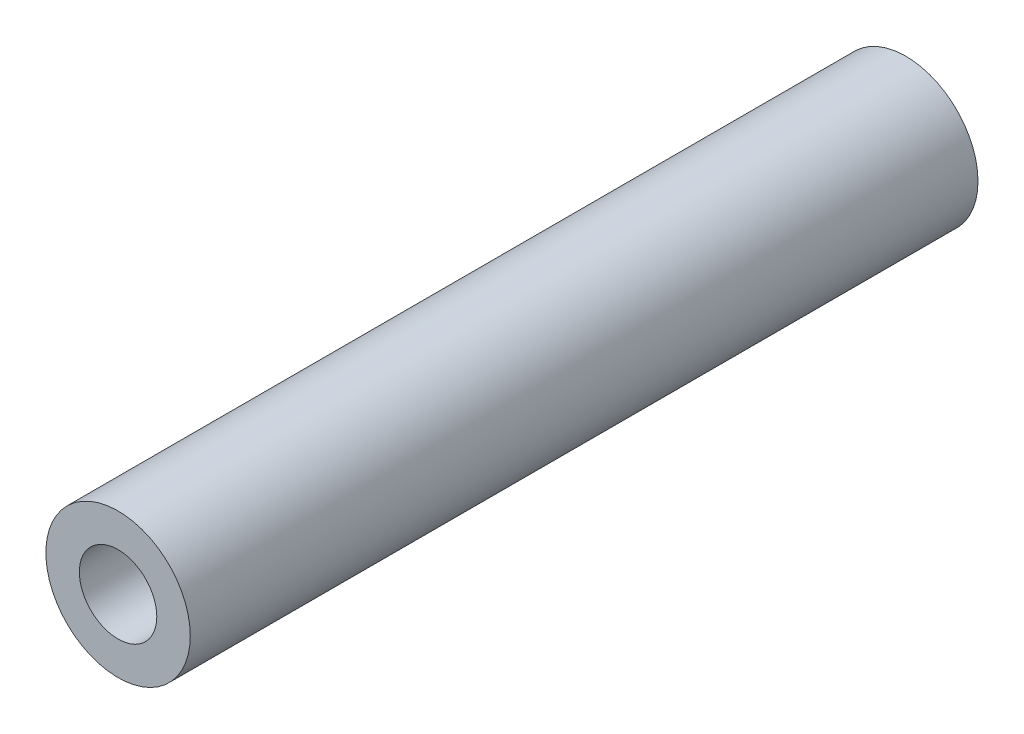
ISO-10303-21;
HEADER;
FILE_DESCRIPTION(('STEP AP214'),'2;1');
FILE_NAME('part.step','',(''),(''),'','','');
FILE_SCHEMA(('AUTOMOTIVE_DESIGN { 1 0 10303 214 1 1 1 1 }'));
ENDSEC;
DATA;
#1=APPLICATION_CONTEXT('core data for automotive mechanical design processes');
#2=APPLICATION_PROTOCOL_DEFINITION('international standard','automotive_design',2000,#1);
#3=PRODUCT_CONTEXT('',#1,'mechanical');
#4=PRODUCT('Part','Part','',(#3));
#5=PRODUCT_RELATED_PRODUCT_CATEGORY('part','',(#4));
#6=PRODUCT_DEFINITION_FORMATION('','',#4);
#7=PRODUCT_DEFINITION_CONTEXT('part definition',#1,'design');
#8=PRODUCT_DEFINITION('design','',#6,#7);
#9=PRODUCT_DEFINITION_SHAPE('','',#8);
#10=(LENGTH_UNIT() NAMED_UNIT(*) SI_UNIT(.MILLI.,.METRE.));
#11=(NAMED_UNIT(*) PLANE_ANGLE_UNIT() SI_UNIT($,.RADIAN.));
#12=(NAMED_UNIT(*) SI_UNIT($,.STERADIAN.) SOLID_ANGLE_UNIT());
#13=UNCERTAINTY_MEASURE_WITH_UNIT(LENGTH_MEASURE(1.E-05),#10,'distance_accuracy_value','');
#14=(GEOMETRIC_REPRESENTATION_CONTEXT(3) GLOBAL_UNCERTAINTY_ASSIGNED_CONTEXT((#13)) GLOBAL_UNIT_ASSIGNED_CONTEXT((#10,
#11,#12)) REPRESENTATION_CONTEXT('',''));
#15=CARTESIAN_POINT('',(0.,0.,0.));
#16=DIRECTION('',(0.,0.,1.));
#17=DIRECTION('',(1.,0.,0.));
#18=AXIS2_PLACEMENT_3D('',#15,#16,#17);
#19=CARTESIAN_POINT('',(0.,0.,60.));
#20=DIRECTION('',(0.,0.,-1.));
#21=DIRECTION('',(-1.,0.,0.));
#22=AXIS2_PLACEMENT_3D('',#19,#20,#21);
#23=CYLINDRICAL_SURFACE('',#22,5.5);
#24=CARTESIAN_POINT('',(0.,0.,60.));
#25=DIRECTION('',(0.,0.,1.));
#26=DIRECTION('',(1.,0.,0.));
#27=AXIS2_PLACEMENT_3D('',#24,#25,#26);
#28=CIRCLE('',#27,5.5);
#29=CARTESIAN_POINT('',(5.5,0.,60.));
#30=VERTEX_POINT('',#29);
#31=EDGE_CURVE('E10',#30,#30,#28,.T.);
#32=ORIENTED_EDGE('',*,*,#31,.F.);
#33=EDGE_LOOP('',(#32));
#34=FACE_BOUND('',#33,.T.);
#35=CARTESIAN_POINT('',(0.,0.,0.));
#36=DIRECTION('',(0.,0.,1.));
#37=DIRECTION('',(1.,0.,0.));
#38=AXIS2_PLACEMENT_3D('',#35,#36,#37);
#39=CIRCLE('',#38,5.5);
#40=CARTESIAN_POINT('',(5.5,0.,0.));
#41=VERTEX_POINT('',#40);
#42=EDGE_CURVE('E42',#41,#41,#39,.T.);
#43=ORIENTED_EDGE('',*,*,#42,.T.);
#44=EDGE_LOOP('',(#43));
#45=FACE_BOUND('',#44,.T.);
#46=ADVANCED_FACE('F35',(#34,#45),#23,.T.);
#47=CARTESIAN_POINT('',(0.,0.,60.));
#48=DIRECTION('',(0.,0.,1.));
#49=DIRECTION('',(1.,0.,0.));
#50=AXIS2_PLACEMENT_3D('',#47,#48,#49);
#51=PLANE('',#50);
#52=CARTESIAN_POINT('',(0.,0.,60.));
#53=DIRECTION('',(0.,0.,1.));
#54=DIRECTION('',(1.,0.,0.));
#55=AXIS2_PLACEMENT_3D('',#52,#53,#54);
#56=CIRCLE('',#55,2.95);
#57=CARTESIAN_POINT('',(2.95,0.,60.));
#58=VERTEX_POINT('',#57);
#59=EDGE_CURVE('E49',#58,#58,#56,.T.);
#60=ORIENTED_EDGE('',*,*,#59,.F.);
#61=EDGE_LOOP('',(#60));
#62=FACE_BOUND('',#61,.T.);
#63=ORIENTED_EDGE('',*,*,#31,.T.);
#64=EDGE_LOOP('',(#63));
#65=FACE_BOUND('',#64,.T.);
#66=ADVANCED_FACE('F76',(#62,#65),#51,.T.);
#67=CARTESIAN_POINT('',(0.,0.,0.));
#68=DIRECTION('',(0.,0.,1.));
#69=DIRECTION('',(1.,0.,0.));
#70=AXIS2_PLACEMENT_3D('',#67,#68,#69);
#71=PLANE('',#70);
#72=CARTESIAN_POINT('',(0.,0.,0.));
#73=DIRECTION('',(0.,0.,-1.));
#74=DIRECTION('',(-1.,0.,0.));
#75=AXIS2_PLACEMENT_3D('',#72,#73,#74);
#76=CIRCLE('',#75,2.025);
#77=CARTESIAN_POINT('',(-2.025,0.,0.));
#78=VERTEX_POINT('',#77);
#79=EDGE_CURVE('E54',#78,#78,#76,.T.);
#80=ORIENTED_EDGE('',*,*,#79,.F.);
#81=EDGE_LOOP('',(#80));
#82=FACE_BOUND('',#81,.T.);
#83=ORIENTED_EDGE('',*,*,#42,.F.);
#84=EDGE_LOOP('',(#83));
#85=FACE_BOUND('',#84,.T.);
#86=ADVANCED_FACE('F72',(#82,#85),#71,.F.);
#87=CARTESIAN_POINT('',(0.,0.,45.));
#88=DIRECTION('',(0.,0.,1.));
#89=DIRECTION('',(1.,0.,0.));
#90=AXIS2_PLACEMENT_3D('',#87,#88,#89);
#91=CYLINDRICAL_SURFACE('',#90,2.95);
#92=CARTESIAN_POINT('',(0.,0.,45.));
#93=DIRECTION('',(0.,0.,1.));
#94=DIRECTION('',(1.,0.,0.));
#95=AXIS2_PLACEMENT_3D('',#92,#93,#94);
#96=CIRCLE('',#95,2.95);
#97=CARTESIAN_POINT('',(2.95,0.,45.));
#98=VERTEX_POINT('',#97);
#99=EDGE_CURVE('E47',#98,#98,#96,.T.);
#100=ORIENTED_EDGE('',*,*,#99,.F.);
#101=EDGE_LOOP('',(#100));
#102=FACE_BOUND('',#101,.T.);
#103=ORIENTED_EDGE('',*,*,#59,.T.);
#104=EDGE_LOOP('',(#103));
#105=FACE_BOUND('',#104,.T.);
#106=ADVANCED_FACE('F66',(#102,#105),#91,.F.);
#107=CARTESIAN_POINT('',(0.,0.,45.));
#108=DIRECTION('',(0.,0.,1.));
#109=DIRECTION('',(1.,0.,0.));
#110=AXIS2_PLACEMENT_3D('',#107,#108,#109);
#111=PLANE('',#110);
#112=CARTESIAN_POINT('',(0.,0.,45.));
#113=DIRECTION('',(0.,0.,1.));
#114=DIRECTION('',(1.,0.,0.));
#115=AXIS2_PLACEMENT_3D('',#112,#113,#114);
#116=CIRCLE('',#115,2.025);
#117=CARTESIAN_POINT('',(2.025,0.,45.));
#118=VERTEX_POINT('',#117);
#119=EDGE_CURVE('E38',#118,#118,#116,.T.);
#120=ORIENTED_EDGE('',*,*,#119,.F.);
#121=EDGE_LOOP('',(#120));
#122=FACE_BOUND('',#121,.T.);
#123=ORIENTED_EDGE('',*,*,#99,.T.);
#124=EDGE_LOOP('',(#123));
#125=FACE_BOUND('',#124,.T.);
#126=ADVANCED_FACE('F63',(#122,#125),#111,.T.);
#127=CARTESIAN_POINT('',(0.,0.,60.));
#128=DIRECTION('',(0.,0.,-1.));
#129=DIRECTION('',(-1.,0.,0.));
#130=AXIS2_PLACEMENT_3D('',#127,#128,#129);
#131=CYLINDRICAL_SURFACE('',#130,2.025);
#132=ORIENTED_EDGE('',*,*,#119,.T.);
#133=EDGE_LOOP('',(#132));
#134=FACE_BOUND('',#133,.T.);
#135=ORIENTED_EDGE('',*,*,#79,.T.);
#136=EDGE_LOOP('',(#135));
#137=FACE_BOUND('',#136,.T.);
#138=ADVANCED_FACE('F61',(#134,#137),#131,.F.);
#139=CLOSED_SHELL('',(#46,#66,#86,#106,#126,#138));
#140=MANIFOLD_SOLID_BREP('B2',#139);
#141=ADVANCED_BREP_SHAPE_REPRESENTATION('',(#18,#140),#14);
#142=SHAPE_DEFINITION_REPRESENTATION(#9,#141);
ENDSEC;
END-ISO-10303-21;
